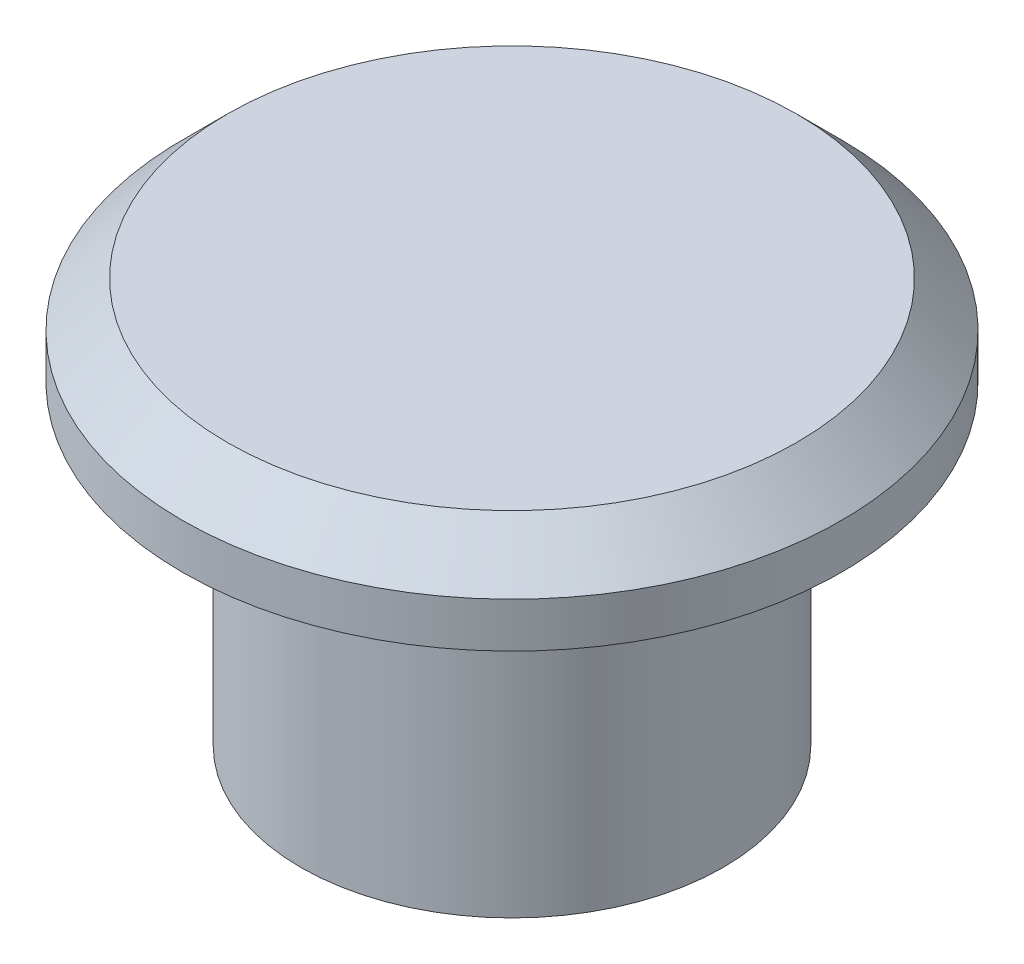
ISO-10303-21;
HEADER;
FILE_DESCRIPTION(('STEP AP214'),'2;1');
FILE_NAME('part.step','',(''),(''),'','','');
FILE_SCHEMA(('AUTOMOTIVE_DESIGN { 1 0 10303 214 1 1 1 1 }'));
ENDSEC;
DATA;
#1=APPLICATION_CONTEXT('core data for automotive mechanical design processes');
#2=APPLICATION_PROTOCOL_DEFINITION('international standard','automotive_design',2000,#1);
#3=PRODUCT_CONTEXT('',#1,'mechanical');
#4=PRODUCT('Part','Part','',(#3));
#5=PRODUCT_RELATED_PRODUCT_CATEGORY('part','',(#4));
#6=PRODUCT_DEFINITION_FORMATION('','',#4);
#7=PRODUCT_DEFINITION_CONTEXT('part definition',#1,'design');
#8=PRODUCT_DEFINITION('design','',#6,#7);
#9=PRODUCT_DEFINITION_SHAPE('','',#8);
#10=(LENGTH_UNIT() NAMED_UNIT(*) SI_UNIT(.MILLI.,.METRE.));
#11=(NAMED_UNIT(*) PLANE_ANGLE_UNIT() SI_UNIT($,.RADIAN.));
#12=(NAMED_UNIT(*) SI_UNIT($,.STERADIAN.) SOLID_ANGLE_UNIT());
#13=UNCERTAINTY_MEASURE_WITH_UNIT(LENGTH_MEASURE(1.E-05),#10,'distance_accuracy_value','');
#14=(GEOMETRIC_REPRESENTATION_CONTEXT(3) GLOBAL_UNCERTAINTY_ASSIGNED_CONTEXT((#13)) GLOBAL_UNIT_ASSIGNED_CONTEXT((#10,
#11,#12)) REPRESENTATION_CONTEXT('',''));
#15=CARTESIAN_POINT('',(0.,0.,0.));
#16=DIRECTION('',(0.,0.,1.));
#17=DIRECTION('',(1.,0.,0.));
#18=AXIS2_PLACEMENT_3D('',#15,#16,#17);
#19=CARTESIAN_POINT('',(0.,7.,0.));
#20=DIRECTION('',(0.,-1.,0.));
#21=DIRECTION('',(0.,0.,-1.));
#22=AXIS2_PLACEMENT_3D('',#19,#20,#21);
#23=CYLINDRICAL_SURFACE('',#22,4.7);
#24=CARTESIAN_POINT('',(0.,7.,0.));
#25=DIRECTION('',(0.,1.,0.));
#26=DIRECTION('',(0.,0.,1.));
#27=AXIS2_PLACEMENT_3D('',#24,#25,#26);
#28=CIRCLE('',#27,4.7);
#29=CARTESIAN_POINT('',(0.,7.,4.7));
#30=VERTEX_POINT('',#29);
#31=EDGE_CURVE('E42',#30,#30,#28,.T.);
#32=ORIENTED_EDGE('',*,*,#31,.F.);
#33=EDGE_LOOP('',(#32));
#34=FACE_BOUND('',#33,.T.);
#35=CARTESIAN_POINT('',(0.,0.,0.));
#36=DIRECTION('',(0.,1.,0.));
#37=DIRECTION('',(0.,0.,1.));
#38=AXIS2_PLACEMENT_3D('',#35,#36,#37);
#39=CIRCLE('',#38,4.7);
#40=CARTESIAN_POINT('',(0.,0.,4.7));
#41=VERTEX_POINT('',#40);
#42=EDGE_CURVE('E46',#41,#41,#39,.T.);
#43=ORIENTED_EDGE('',*,*,#42,.T.);
#44=EDGE_LOOP('',(#43));
#45=FACE_BOUND('',#44,.T.);
#46=ADVANCED_FACE('F31',(#34,#45),#23,.T.);
#47=CARTESIAN_POINT('',(0.,0.,0.));
#48=DIRECTION('',(0.,1.,0.));
#49=DIRECTION('',(0.,0.,1.));
#50=AXIS2_PLACEMENT_3D('',#47,#48,#49);
#51=PLANE('',#50);
#52=CARTESIAN_POINT('',(0.,0.,0.));
#53=DIRECTION('',(0.,1.,0.));
#54=DIRECTION('',(0.,0.,1.));
#55=AXIS2_PLACEMENT_3D('',#52,#53,#54);
#56=CIRCLE('',#55,3.50699835711674);
#57=CARTESIAN_POINT('',(0.,0.,3.50699835711674));
#58=VERTEX_POINT('',#57);
#59=EDGE_CURVE('E50',#58,#58,#56,.T.);
#60=ORIENTED_EDGE('',*,*,#59,.T.);
#61=EDGE_LOOP('',(#60));
#62=FACE_BOUND('',#61,.T.);
#63=ORIENTED_EDGE('',*,*,#42,.F.);
#64=EDGE_LOOP('',(#63));
#65=FACE_BOUND('',#64,.T.);
#66=ADVANCED_FACE('F72',(#62,#65),#51,.F.);
#67=CARTESIAN_POINT('',(0.,0.,0.));
#68=DIRECTION('',(0.,1.,0.));
#69=DIRECTION('',(0.,0.,1.));
#70=AXIS2_PLACEMENT_3D('',#67,#68,#69);
#71=CYLINDRICAL_SURFACE('',#70,3.50699835711674);
#72=ORIENTED_EDGE('',*,*,#59,.F.);
#73=EDGE_LOOP('',(#72));
#74=FACE_BOUND('',#73,.T.);
#75=CARTESIAN_POINT('',(0.,7.,0.));
#76=DIRECTION('',(0.,1.,0.));
#77=DIRECTION('',(0.,0.,1.));
#78=AXIS2_PLACEMENT_3D('',#75,#76,#77);
#79=CIRCLE('',#78,3.50699835711674);
#80=CARTESIAN_POINT('',(0.,7.,3.50699835711674));
#81=VERTEX_POINT('',#80);
#82=EDGE_CURVE('E54',#81,#81,#79,.F.);
#83=ORIENTED_EDGE('',*,*,#82,.F.);
#84=EDGE_LOOP('',(#83));
#85=FACE_BOUND('',#84,.T.);
#86=ADVANCED_FACE('F76',(#74,#85),#71,.F.);
#87=CARTESIAN_POINT('',(0.,7.,0.));
#88=DIRECTION('',(0.,1.,0.));
#89=DIRECTION('',(0.,0.,1.));
#90=AXIS2_PLACEMENT_3D('',#87,#88,#89);
#91=PLANE('',#90);
#92=ORIENTED_EDGE('',*,*,#82,.T.);
#93=EDGE_LOOP('',(#92));
#94=FACE_BOUND('',#93,.T.);
#95=ADVANCED_FACE('F66',(#94),#91,.F.);
#96=CARTESIAN_POINT('',(0.,7.,0.));
#97=DIRECTION('',(0.,1.,0.));
#98=DIRECTION('',(0.,0.,1.));
#99=AXIS2_PLACEMENT_3D('',#96,#97,#98);
#100=CIRCLE('',#99,7.33068446054537);
#101=CARTESIAN_POINT('',(0.,7.,7.33068446054537));
#102=VERTEX_POINT('',#101);
#103=EDGE_CURVE('E57',#102,#102,#100,.T.);
#104=ORIENTED_EDGE('',*,*,#103,.F.);
#105=EDGE_LOOP('',(#104));
#106=FACE_BOUND('',#105,.T.);
#107=ORIENTED_EDGE('',*,*,#31,.T.);
#108=EDGE_LOOP('',(#107));
#109=FACE_BOUND('',#108,.T.);
#110=ADVANCED_FACE('F63',(#106,#109),#91,.F.);
#111=CARTESIAN_POINT('',(0.,9.,0.));
#112=DIRECTION('',(0.,-1.,0.));
#113=DIRECTION('',(0.,0.,-1.));
#114=AXIS2_PLACEMENT_3D('',#111,#112,#113);
#115=CYLINDRICAL_SURFACE('',#114,7.33068446054537);
#116=CARTESIAN_POINT('',(0.,7.99999999999999,0.));
#117=DIRECTION('',(0.,1.,0.));
#118=DIRECTION('',(0.,0.,1.));
#119=AXIS2_PLACEMENT_3D('',#116,#117,#118);
#120=CIRCLE('',#119,7.33068446054537);
#121=CARTESIAN_POINT('',(0.,7.99999999999999,7.33068446054537));
#122=VERTEX_POINT('',#121);
#123=EDGE_CURVE('E10',#122,#122,#120,.F.);
#124=ORIENTED_EDGE('',*,*,#123,.T.);
#125=EDGE_LOOP('',(#124));
#126=FACE_BOUND('',#125,.T.);
#127=ORIENTED_EDGE('',*,*,#103,.T.);
#128=EDGE_LOOP('',(#127));
#129=FACE_BOUND('',#128,.T.);
#130=ADVANCED_FACE('F61',(#126,#129),#115,.T.);
#131=CARTESIAN_POINT('',(0.,9.,0.));
#132=DIRECTION('',(0.,1.,0.));
#133=DIRECTION('',(0.,0.,1.));
#134=AXIS2_PLACEMENT_3D('',#131,#132,#133);
#135=PLANE('',#134);
#136=CARTESIAN_POINT('',(0.,9.,0.));
#137=DIRECTION('',(0.,1.,0.));
#138=DIRECTION('',(0.,0.,1.));
#139=AXIS2_PLACEMENT_3D('',#136,#137,#138);
#140=CIRCLE('',#139,6.33068446054537);
#141=CARTESIAN_POINT('',(0.,9.,6.33068446054537));
#142=VERTEX_POINT('',#141);
#143=EDGE_CURVE('E38',#142,#142,#140,.T.);
#144=ORIENTED_EDGE('',*,*,#143,.T.);
#145=EDGE_LOOP('',(#144));
#146=FACE_BOUND('',#145,.T.);
#147=ADVANCED_FACE('F86',(#146),#135,.T.);
#148=CARTESIAN_POINT('',(0.,9.,0.));
#149=DIRECTION('',(0.,-1.,0.));
#150=DIRECTION('',(0.,0.,-1.));
#151=AXIS2_PLACEMENT_3D('',#148,#149,#150);
#152=CONICAL_SURFACE('',#151,6.33068446054537,0.785398163397446);
#153=ORIENTED_EDGE('',*,*,#123,.F.);
#154=EDGE_LOOP('',(#153));
#155=FACE_BOUND('',#154,.T.);
#156=ORIENTED_EDGE('',*,*,#143,.F.);
#157=EDGE_LOOP('',(#156));
#158=FACE_BOUND('',#157,.T.);
#159=ADVANCED_FACE('F33',(#155,#158),#152,.T.);
#160=CLOSED_SHELL('',(#46,#66,#86,#95,#110,#130,#147,#159));
#161=MANIFOLD_SOLID_BREP('B2',#160);
#162=ADVANCED_BREP_SHAPE_REPRESENTATION('',(#18,#161),#14);
#163=SHAPE_DEFINITION_REPRESENTATION(#9,#162);
ENDSEC;
END-ISO-10303-21;
